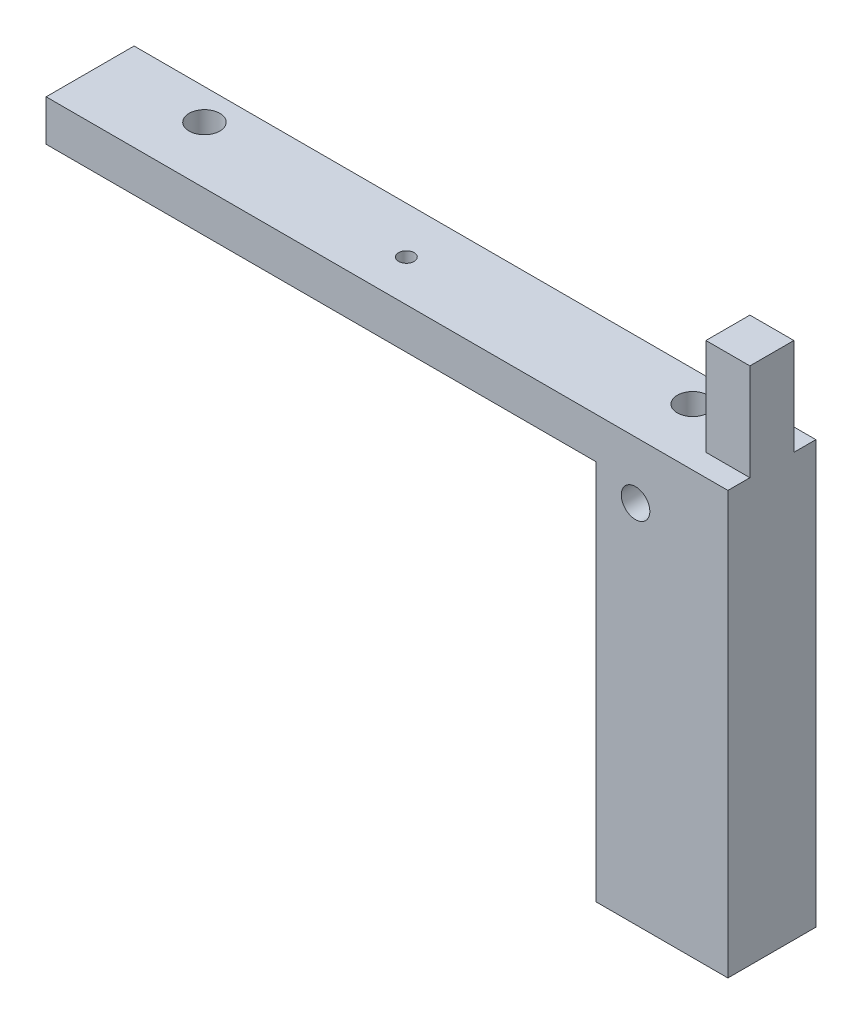
ISO-10303-21;
HEADER;
FILE_DESCRIPTION(('STEP AP214'),'2;1');
FILE_NAME('part.step','',(''),(''),'','','');
FILE_SCHEMA(('AUTOMOTIVE_DESIGN { 1 0 10303 214 1 1 1 1 }'));
ENDSEC;
DATA;
#1=APPLICATION_CONTEXT('core data for automotive mechanical design processes');
#2=APPLICATION_PROTOCOL_DEFINITION('international standard','automotive_design',2000,#1);
#3=PRODUCT_CONTEXT('',#1,'mechanical');
#4=PRODUCT('Part','Part','',(#3));
#5=PRODUCT_RELATED_PRODUCT_CATEGORY('part','',(#4));
#6=PRODUCT_DEFINITION_FORMATION('','',#4);
#7=PRODUCT_DEFINITION_CONTEXT('part definition',#1,'design');
#8=PRODUCT_DEFINITION('design','',#6,#7);
#9=PRODUCT_DEFINITION_SHAPE('','',#8);
#10=(LENGTH_UNIT() NAMED_UNIT(*) SI_UNIT(.MILLI.,.METRE.));
#11=(NAMED_UNIT(*) PLANE_ANGLE_UNIT() SI_UNIT($,.RADIAN.));
#12=(NAMED_UNIT(*) SI_UNIT($,.STERADIAN.) SOLID_ANGLE_UNIT());
#13=UNCERTAINTY_MEASURE_WITH_UNIT(LENGTH_MEASURE(1.E-05),#10,'distance_accuracy_value','');
#14=(GEOMETRIC_REPRESENTATION_CONTEXT(3) GLOBAL_UNCERTAINTY_ASSIGNED_CONTEXT((#13)) GLOBAL_UNIT_ASSIGNED_CONTEXT((#10,
#11,#12)) REPRESENTATION_CONTEXT('',''));
#15=CARTESIAN_POINT('',(0.,0.,0.));
#16=DIRECTION('',(0.,0.,1.));
#17=DIRECTION('',(1.,0.,0.));
#18=AXIS2_PLACEMENT_3D('',#15,#16,#17);
#19=CARTESIAN_POINT('',(0.,0.,0.));
#20=DIRECTION('',(0.,0.,1.));
#21=DIRECTION('',(1.,0.,0.));
#22=AXIS2_PLACEMENT_3D('',#19,#20,#21);
#23=PLANE('',#22);
#24=DIRECTION('',(1.,0.,0.));
#25=VECTOR('',#24,1.);
#26=CARTESIAN_POINT('',(0.,0.,0.));
#27=LINE('',#26,#25);
#28=CARTESIAN_POINT('',(20.,0.,0.));
#29=VERTEX_POINT('',#28);
#30=CARTESIAN_POINT('',(30.,0.,0.));
#31=VERTEX_POINT('',#30);
#32=EDGE_CURVE('E11',#29,#31,#27,.T.);
#33=ORIENTED_EDGE('',*,*,#32,.F.);
#34=DIRECTION('',(0.,-1.,0.));
#35=VECTOR('',#34,1.);
#36=CARTESIAN_POINT('',(20.,0.,0.));
#37=LINE('',#36,#35);
#38=CARTESIAN_POINT('',(20.,22.02,0.));
#39=VERTEX_POINT('',#38);
#40=EDGE_CURVE('E149',#39,#29,#37,.T.);
#41=ORIENTED_EDGE('',*,*,#40,.F.);
#42=DIRECTION('',(-1.,0.,0.));
#43=VECTOR('',#42,1.);
#44=CARTESIAN_POINT('',(20.,22.02,0.));
#45=LINE('',#44,#43);
#46=CARTESIAN_POINT('',(30.,22.02,0.));
#47=VERTEX_POINT('',#46);
#48=EDGE_CURVE('E233',#47,#39,#45,.T.);
#49=ORIENTED_EDGE('',*,*,#48,.F.);
#50=DIRECTION('',(0.,1.,0.));
#51=VECTOR('',#50,1.);
#52=CARTESIAN_POINT('',(30.,22.02,0.));
#53=LINE('',#52,#51);
#54=EDGE_CURVE('E222',#31,#47,#53,.T.);
#55=ORIENTED_EDGE('',*,*,#54,.F.);
#56=EDGE_LOOP('',(#33,#41,#49,#55));
#57=FACE_BOUND('',#56,.T.);
#58=ADVANCED_FACE('F41',(#57),#23,.F.);
#59=CARTESIAN_POINT('',(0.,0.,10.));
#60=DIRECTION('',(0.,-1.,0.));
#61=DIRECTION('',(0.,0.,-1.));
#62=AXIS2_PLACEMENT_3D('',#59,#60,#61);
#63=PLANE('',#62);
#64=CARTESIAN_POINT('',(9.00000000000004,0.,2.00000000000012));
#65=DIRECTION('',(0.,1.,0.));
#66=DIRECTION('',(0.,0.,1.));
#67=AXIS2_PLACEMENT_3D('',#64,#65,#66);
#68=CIRCLE('',#67,3.5);
#69=CARTESIAN_POINT('',(9.00000000000004,0.,5.50000000000012));
#70=VERTEX_POINT('',#69);
#71=EDGE_CURVE('E262',#70,#70,#68,.T.);
#72=ORIENTED_EDGE('',*,*,#71,.F.);
#73=EDGE_LOOP('',(#72));
#74=FACE_BOUND('',#73,.T.);
#75=CARTESIAN_POINT('',(-102.,0.,2.00000000000001));
#76=DIRECTION('',(0.,1.,0.));
#77=DIRECTION('',(0.,0.,1.));
#78=AXIS2_PLACEMENT_3D('',#75,#76,#77);
#79=CIRCLE('',#78,3.50000000000001);
#80=CARTESIAN_POINT('',(-102.,0.,5.50000000000002));
#81=VERTEX_POINT('',#80);
#82=EDGE_CURVE('E254',#81,#81,#79,.T.);
#83=ORIENTED_EDGE('',*,*,#82,.F.);
#84=EDGE_LOOP('',(#83));
#85=FACE_BOUND('',#84,.T.);
#86=CARTESIAN_POINT('',(-52.5,0.,5.59760322214288));
#87=DIRECTION('',(0.,-1.,0.));
#88=DIRECTION('',(0.,0.,-1.));
#89=AXIS2_PLACEMENT_3D('',#86,#87,#88);
#90=CIRCLE('',#89,1.75);
#91=CARTESIAN_POINT('',(-52.5,0.,3.84760322214288));
#92=VERTEX_POINT('',#91);
#93=EDGE_CURVE('E249',#92,#92,#90,.F.);
#94=ORIENTED_EDGE('',*,*,#93,.F.);
#95=EDGE_LOOP('',(#94));
#96=FACE_BOUND('',#95,.T.);
#97=DIRECTION('',(0.,0.,-1.));
#98=VECTOR('',#97,1.);
#99=CARTESIAN_POINT('',(20.,0.,10.));
#100=LINE('',#99,#98);
#101=CARTESIAN_POINT('',(20.,0.,10.));
#102=VERTEX_POINT('',#101);
#103=EDGE_CURVE('E231',#102,#29,#100,.T.);
#104=ORIENTED_EDGE('',*,*,#103,.T.);
#105=ORIENTED_EDGE('',*,*,#32,.T.);
#106=DIRECTION('',(0.,0.,1.));
#107=VECTOR('',#106,1.);
#108=CARTESIAN_POINT('',(30.,0.,-5.));
#109=LINE('',#108,#107);
#110=CARTESIAN_POINT('',(30.,0.,-5.));
#111=VERTEX_POINT('',#110);
#112=EDGE_CURVE('E207',#111,#31,#109,.T.);
#113=ORIENTED_EDGE('',*,*,#112,.F.);
#114=DIRECTION('',(1.,0.,0.));
#115=VECTOR('',#114,1.);
#116=CARTESIAN_POINT('',(0.,0.,-5.));
#117=LINE('',#116,#115);
#118=CARTESIAN_POINT('',(-125.,0.,-5.));
#119=VERTEX_POINT('',#118);
#120=EDGE_CURVE('E184',#119,#111,#117,.T.);
#121=ORIENTED_EDGE('',*,*,#120,.F.);
#122=DIRECTION('',(0.,0.,-1.));
#123=VECTOR('',#122,1.);
#124=CARTESIAN_POINT('',(-125.,0.,0.));
#125=LINE('',#124,#123);
#126=CARTESIAN_POINT('',(-125.,0.,15.));
#127=VERTEX_POINT('',#126);
#128=EDGE_CURVE('E174',#127,#119,#125,.T.);
#129=ORIENTED_EDGE('',*,*,#128,.F.);
#130=DIRECTION('',(-1.,0.,0.));
#131=VECTOR('',#130,1.);
#132=CARTESIAN_POINT('',(0.,0.,15.));
#133=LINE('',#132,#131);
#134=CARTESIAN_POINT('',(30.,0.,15.));
#135=VERTEX_POINT('',#134);
#136=EDGE_CURVE('E216',#135,#127,#133,.T.);
#137=ORIENTED_EDGE('',*,*,#136,.F.);
#138=DIRECTION('',(0.,0.,-1.));
#139=VECTOR('',#138,1.);
#140=CARTESIAN_POINT('',(30.,0.,15.));
#141=LINE('',#140,#139);
#142=CARTESIAN_POINT('',(30.,0.,10.));
#143=VERTEX_POINT('',#142);
#144=EDGE_CURVE('E218',#135,#143,#141,.T.);
#145=ORIENTED_EDGE('',*,*,#144,.T.);
#146=DIRECTION('',(-1.,0.,0.));
#147=VECTOR('',#146,1.);
#148=CARTESIAN_POINT('',(0.,0.,10.));
#149=LINE('',#148,#147);
#150=EDGE_CURVE('E66',#143,#102,#149,.T.);
#151=ORIENTED_EDGE('',*,*,#150,.T.);
#152=EDGE_LOOP('',(#104,#105,#113,#121,#129,#137,#145,#151));
#153=FACE_BOUND('',#152,.T.);
#154=ADVANCED_FACE('F43',(#74,#85,#96,#153),#63,.F.);
#155=CARTESIAN_POINT('',(0.,0.,10.));
#156=DIRECTION('',(1.,0.,0.));
#157=DIRECTION('',(0.,1.,0.));
#158=AXIS2_PLACEMENT_3D('',#155,#156,#157);
#159=PLANE('',#158);
#160=DIRECTION('',(0.,-1.,0.));
#161=VECTOR('',#160,1.);
#162=CARTESIAN_POINT('',(0.,0.,15.));
#163=LINE('',#162,#161);
#164=CARTESIAN_POINT('',(0.,-9.34852743302377,15.));
#165=VERTEX_POINT('',#164);
#166=CARTESIAN_POINT('',(0.,-95.9999999999997,15.));
#167=VERTEX_POINT('',#166);
#168=EDGE_CURVE('E212',#165,#167,#163,.T.);
#169=ORIENTED_EDGE('',*,*,#168,.F.);
#170=DIRECTION('',(0.,0.,-1.));
#171=VECTOR('',#170,1.);
#172=CARTESIAN_POINT('',(0.,-9.34852743302377,0.));
#173=LINE('',#172,#171);
#174=CARTESIAN_POINT('',(0.,-9.34852743302377,10.));
#175=VERTEX_POINT('',#174);
#176=EDGE_CURVE('E163',#165,#175,#173,.T.);
#177=ORIENTED_EDGE('',*,*,#176,.T.);
#178=DIRECTION('',(0.,-1.,0.));
#179=VECTOR('',#178,1.);
#180=CARTESIAN_POINT('',(0.,0.,10.));
#181=LINE('',#180,#179);
#182=CARTESIAN_POINT('',(0.,-95.9999999999997,9.99999999999996));
#183=VERTEX_POINT('',#182);
#184=EDGE_CURVE('E211',#175,#183,#181,.T.);
#185=ORIENTED_EDGE('',*,*,#184,.T.);
#186=DIRECTION('',(0.,0.,-1.));
#187=VECTOR('',#186,1.);
#188=CARTESIAN_POINT('',(0.,-95.9999999999997,15.));
#189=LINE('',#188,#187);
#190=EDGE_CURVE('E185',#167,#183,#189,.T.);
#191=ORIENTED_EDGE('',*,*,#190,.F.);
#192=EDGE_LOOP('',(#169,#177,#185,#191));
#193=FACE_BOUND('',#192,.T.);
#194=ADVANCED_FACE('F271',(#193),#159,.F.);
#195=CARTESIAN_POINT('',(0.,-5.,10.));
#196=DIRECTION('',(0.,1.,0.));
#197=DIRECTION('',(0.,0.,1.));
#198=AXIS2_PLACEMENT_3D('',#195,#196,#197);
#199=PLANE('',#198);
#200=CARTESIAN_POINT('',(9.00000000000004,-5.,2.00000000000012));
#201=DIRECTION('',(0.,1.,0.));
#202=DIRECTION('',(0.,0.,1.));
#203=AXIS2_PLACEMENT_3D('',#200,#201,#202);
#204=CIRCLE('',#203,3.5);
#205=CARTESIAN_POINT('',(9.00000000000004,-5.,5.50000000000012));
#206=VERTEX_POINT('',#205);
#207=EDGE_CURVE('E45',#206,#206,#204,.T.);
#208=ORIENTED_EDGE('',*,*,#207,.T.);
#209=EDGE_LOOP('',(#208));
#210=FACE_BOUND('',#209,.T.);
#211=CARTESIAN_POINT('',(-102.,-5.,2.00000000000001));
#212=DIRECTION('',(0.,1.,0.));
#213=DIRECTION('',(0.,0.,1.));
#214=AXIS2_PLACEMENT_3D('',#211,#212,#213);
#215=CIRCLE('',#214,3.50000000000001);
#216=CARTESIAN_POINT('',(-102.,-5.,5.50000000000002));
#217=VERTEX_POINT('',#216);
#218=EDGE_CURVE('E252',#217,#217,#215,.T.);
#219=ORIENTED_EDGE('',*,*,#218,.T.);
#220=EDGE_LOOP('',(#219));
#221=FACE_BOUND('',#220,.T.);
#222=CARTESIAN_POINT('',(-52.5,-5.,5.59760322214288));
#223=DIRECTION('',(0.,1.,0.));
#224=DIRECTION('',(0.,0.,1.));
#225=AXIS2_PLACEMENT_3D('',#222,#223,#224);
#226=CIRCLE('',#225,1.75);
#227=CARTESIAN_POINT('',(-52.5,-5.,7.34760322214289));
#228=VERTEX_POINT('',#227);
#229=EDGE_CURVE('E250',#228,#228,#226,.F.);
#230=ORIENTED_EDGE('',*,*,#229,.F.);
#231=EDGE_LOOP('',(#230));
#232=FACE_BOUND('',#231,.T.);
#233=DIRECTION('',(1.,0.,0.));
#234=VECTOR('',#233,1.);
#235=CARTESIAN_POINT('',(0.,-5.,10.));
#236=LINE('',#235,#234);
#237=CARTESIAN_POINT('',(-125.,-5.00000000000002,10.));
#238=VERTEX_POINT('',#237);
#239=CARTESIAN_POINT('',(20.,-5.,10.));
#240=VERTEX_POINT('',#239);
#241=EDGE_CURVE('E140',#238,#240,#236,.T.);
#242=ORIENTED_EDGE('',*,*,#241,.F.);
#243=DIRECTION('',(0.,0.,1.));
#244=VECTOR('',#243,1.);
#245=CARTESIAN_POINT('',(-125.,-5.00000000000002,0.));
#246=LINE('',#245,#244);
#247=CARTESIAN_POINT('',(-125.,-5.00000000000002,-5.));
#248=VERTEX_POINT('',#247);
#249=EDGE_CURVE('E145',#248,#238,#246,.T.);
#250=ORIENTED_EDGE('',*,*,#249,.F.);
#251=DIRECTION('',(-1.,0.,0.));
#252=VECTOR('',#251,1.);
#253=CARTESIAN_POINT('',(0.,-5.,-5.));
#254=LINE('',#253,#252);
#255=CARTESIAN_POINT('',(20.,-5.,-5.));
#256=VERTEX_POINT('',#255);
#257=EDGE_CURVE('E206',#256,#248,#254,.T.);
#258=ORIENTED_EDGE('',*,*,#257,.F.);
#259=DIRECTION('',(0.,0.,-1.));
#260=VECTOR('',#259,1.);
#261=CARTESIAN_POINT('',(20.,-5.,10.));
#262=LINE('',#261,#260);
#263=EDGE_CURVE('E50',#240,#256,#262,.T.);
#264=ORIENTED_EDGE('',*,*,#263,.F.);
#265=EDGE_LOOP('',(#242,#250,#258,#264));
#266=FACE_BOUND('',#265,.T.);
#267=ADVANCED_FACE('F142',(#210,#221,#232,#266),#199,.F.);
#268=CARTESIAN_POINT('',(20.,-5.,10.));
#269=DIRECTION('',(1.,0.,0.));
#270=DIRECTION('',(0.,0.,-1.));
#271=AXIS2_PLACEMENT_3D('',#268,#269,#270);
#272=PLANE('',#271);
#273=ORIENTED_EDGE('',*,*,#263,.T.);
#274=DIRECTION('',(0.,1.,0.));
#275=VECTOR('',#274,1.);
#276=CARTESIAN_POINT('',(20.,0.,-5.));
#277=LINE('',#276,#275);
#278=CARTESIAN_POINT('',(20.,-95.9999999999997,-5.00000000000005));
#279=VERTEX_POINT('',#278);
#280=EDGE_CURVE('E203',#279,#256,#277,.T.);
#281=ORIENTED_EDGE('',*,*,#280,.F.);
#282=DIRECTION('',(0.,0.,-1.));
#283=VECTOR('',#282,1.);
#284=CARTESIAN_POINT('',(20.,-95.9999999999997,10.));
#285=LINE('',#284,#283);
#286=CARTESIAN_POINT('',(20.,-95.9999999999997,9.99999999999995));
#287=VERTEX_POINT('',#286);
#288=EDGE_CURVE('E191',#287,#279,#285,.T.);
#289=ORIENTED_EDGE('',*,*,#288,.F.);
#290=DIRECTION('',(0.,-1.,0.));
#291=VECTOR('',#290,1.);
#292=CARTESIAN_POINT('',(20.,-5.,10.));
#293=LINE('',#292,#291);
#294=EDGE_CURVE('E148',#240,#287,#293,.T.);
#295=ORIENTED_EDGE('',*,*,#294,.F.);
#296=EDGE_LOOP('',(#273,#281,#289,#295));
#297=FACE_BOUND('',#296,.T.);
#298=ADVANCED_FACE('F307',(#297),#272,.F.);
#299=CARTESIAN_POINT('',(30.,22.02,10.));
#300=DIRECTION('',(-1.,0.,0.));
#301=DIRECTION('',(0.,0.,1.));
#302=AXIS2_PLACEMENT_3D('',#299,#300,#301);
#303=PLANE('',#302);
#304=DIRECTION('',(0.,1.,0.));
#305=VECTOR('',#304,1.);
#306=CARTESIAN_POINT('',(30.,0.,15.));
#307=LINE('',#306,#305);
#308=CARTESIAN_POINT('',(30.,-95.9999999999997,15.));
#309=VERTEX_POINT('',#308);
#310=EDGE_CURVE('E214',#309,#135,#307,.T.);
#311=ORIENTED_EDGE('',*,*,#310,.F.);
#312=DIRECTION('',(0.,0.,1.));
#313=VECTOR('',#312,1.);
#314=CARTESIAN_POINT('',(30.,-95.9999999999997,-5.));
#315=LINE('',#314,#313);
#316=CARTESIAN_POINT('',(30.,-95.9999999999997,-5.00000000000006));
#317=VERTEX_POINT('',#316);
#318=EDGE_CURVE('E180',#317,#309,#315,.T.);
#319=ORIENTED_EDGE('',*,*,#318,.F.);
#320=DIRECTION('',(0.,-1.,0.));
#321=VECTOR('',#320,1.);
#322=CARTESIAN_POINT('',(30.,0.,-5.));
#323=LINE('',#322,#321);
#324=EDGE_CURVE('E201',#111,#317,#323,.T.);
#325=ORIENTED_EDGE('',*,*,#324,.F.);
#326=ORIENTED_EDGE('',*,*,#112,.T.);
#327=ORIENTED_EDGE('',*,*,#54,.T.);
#328=DIRECTION('',(0.,0.,-1.));
#329=VECTOR('',#328,1.);
#330=CARTESIAN_POINT('',(30.,22.02,10.));
#331=LINE('',#330,#329);
#332=CARTESIAN_POINT('',(30.,22.02,10.));
#333=VERTEX_POINT('',#332);
#334=EDGE_CURVE('E242',#333,#47,#331,.T.);
#335=ORIENTED_EDGE('',*,*,#334,.F.);
#336=DIRECTION('',(0.,1.,0.));
#337=VECTOR('',#336,1.);
#338=CARTESIAN_POINT('',(30.,22.02,10.));
#339=LINE('',#338,#337);
#340=EDGE_CURVE('E225',#143,#333,#339,.T.);
#341=ORIENTED_EDGE('',*,*,#340,.F.);
#342=ORIENTED_EDGE('',*,*,#144,.F.);
#343=EDGE_LOOP('',(#311,#319,#325,#326,#327,#335,#341,#342));
#344=FACE_BOUND('',#343,.T.);
#345=ADVANCED_FACE('F284',(#344),#303,.F.);
#346=CARTESIAN_POINT('',(20.,22.02,10.));
#347=DIRECTION('',(0.,-1.,0.));
#348=DIRECTION('',(0.,0.,-1.));
#349=AXIS2_PLACEMENT_3D('',#346,#347,#348);
#350=PLANE('',#349);
#351=ORIENTED_EDGE('',*,*,#48,.T.);
#352=DIRECTION('',(0.,0.,-1.));
#353=VECTOR('',#352,1.);
#354=CARTESIAN_POINT('',(20.,22.02,10.));
#355=LINE('',#354,#353);
#356=CARTESIAN_POINT('',(20.,22.02,10.));
#357=VERTEX_POINT('',#356);
#358=EDGE_CURVE('E239',#357,#39,#355,.T.);
#359=ORIENTED_EDGE('',*,*,#358,.F.);
#360=DIRECTION('',(-1.,0.,0.));
#361=VECTOR('',#360,1.);
#362=CARTESIAN_POINT('',(20.,22.02,10.));
#363=LINE('',#362,#361);
#364=EDGE_CURVE('E227',#333,#357,#363,.T.);
#365=ORIENTED_EDGE('',*,*,#364,.F.);
#366=ORIENTED_EDGE('',*,*,#334,.T.);
#367=EDGE_LOOP('',(#351,#359,#365,#366));
#368=FACE_BOUND('',#367,.T.);
#369=ADVANCED_FACE('F287',(#368),#350,.F.);
#370=CARTESIAN_POINT('',(20.,0.,10.));
#371=DIRECTION('',(1.,0.,0.));
#372=DIRECTION('',(0.,0.,-1.));
#373=AXIS2_PLACEMENT_3D('',#370,#371,#372);
#374=PLANE('',#373);
#375=ORIENTED_EDGE('',*,*,#40,.T.);
#376=ORIENTED_EDGE('',*,*,#103,.F.);
#377=DIRECTION('',(0.,-1.,0.));
#378=VECTOR('',#377,1.);
#379=CARTESIAN_POINT('',(20.,0.,10.));
#380=LINE('',#379,#378);
#381=EDGE_CURVE('E229',#357,#102,#380,.T.);
#382=ORIENTED_EDGE('',*,*,#381,.F.);
#383=ORIENTED_EDGE('',*,*,#358,.T.);
#384=EDGE_LOOP('',(#375,#376,#382,#383));
#385=FACE_BOUND('',#384,.T.);
#386=ADVANCED_FACE('F277',(#385),#374,.F.);
#387=CARTESIAN_POINT('',(0.,0.,10.));
#388=DIRECTION('',(0.,0.,1.));
#389=DIRECTION('',(1.,0.,0.));
#390=AXIS2_PLACEMENT_3D('',#387,#388,#389);
#391=PLANE('',#390);
#392=ORIENTED_EDGE('',*,*,#150,.F.);
#393=ORIENTED_EDGE('',*,*,#340,.T.);
#394=ORIENTED_EDGE('',*,*,#364,.T.);
#395=ORIENTED_EDGE('',*,*,#381,.T.);
#396=EDGE_LOOP('',(#392,#393,#394,#395));
#397=FACE_BOUND('',#396,.T.);
#398=ADVANCED_FACE('F288',(#397),#391,.T.);
#399=CARTESIAN_POINT('',(0.,0.,10.));
#400=DIRECTION('',(0.,0.,1.));
#401=DIRECTION('',(1.,0.,0.));
#402=AXIS2_PLACEMENT_3D('',#399,#400,#401);
#403=PLANE('',#402);
#404=CARTESIAN_POINT('',(8.99999999999999,-12.9999999999998,10.));
#405=DIRECTION('',(0.,0.,1.));
#406=DIRECTION('',(1.,0.,0.));
#407=AXIS2_PLACEMENT_3D('',#404,#405,#406);
#408=CIRCLE('',#407,3.24999999999995);
#409=CARTESIAN_POINT('',(12.2499999999999,-12.9999999999998,10.));
#410=VERTEX_POINT('',#409);
#411=EDGE_CURVE('E165',#410,#410,#408,.F.);
#412=ORIENTED_EDGE('',*,*,#411,.F.);
#413=EDGE_LOOP('',(#412));
#414=FACE_BOUND('',#413,.T.);
#415=ORIENTED_EDGE('',*,*,#184,.F.);
#416=DIRECTION('',(1.,0.,0.));
#417=VECTOR('',#416,1.);
#418=CARTESIAN_POINT('',(-125.,-9.34852743302379,10.));
#419=LINE('',#418,#417);
#420=CARTESIAN_POINT('',(-125.,-9.34852743302379,10.));
#421=VERTEX_POINT('',#420);
#422=EDGE_CURVE('E58',#421,#175,#419,.T.);
#423=ORIENTED_EDGE('',*,*,#422,.F.);
#424=DIRECTION('',(0.,-1.,0.));
#425=VECTOR('',#424,1.);
#426=CARTESIAN_POINT('',(-125.,0.,10.));
#427=LINE('',#426,#425);
#428=EDGE_CURVE('E151',#238,#421,#427,.T.);
#429=ORIENTED_EDGE('',*,*,#428,.F.);
#430=ORIENTED_EDGE('',*,*,#241,.T.);
#431=ORIENTED_EDGE('',*,*,#294,.T.);
#432=DIRECTION('',(1.,0.,0.));
#433=VECTOR('',#432,1.);
#434=CARTESIAN_POINT('',(0.,-95.9999999999997,10.));
#435=LINE('',#434,#433);
#436=EDGE_CURVE('E194',#183,#287,#435,.T.);
#437=ORIENTED_EDGE('',*,*,#436,.F.);
#438=EDGE_LOOP('',(#415,#423,#429,#430,#431,#437));
#439=FACE_BOUND('',#438,.T.);
#440=ADVANCED_FACE('F153',(#414,#439),#403,.F.);
#441=CARTESIAN_POINT('',(0.,0.,15.));
#442=DIRECTION('',(0.,0.,1.));
#443=DIRECTION('',(1.,0.,0.));
#444=AXIS2_PLACEMENT_3D('',#441,#442,#443);
#445=PLANE('',#444);
#446=CARTESIAN_POINT('',(8.99999999999999,-12.9999999999998,15.));
#447=DIRECTION('',(0.,0.,1.));
#448=DIRECTION('',(1.,0.,0.));
#449=AXIS2_PLACEMENT_3D('',#446,#447,#448);
#450=CIRCLE('',#449,3.24999999999995);
#451=CARTESIAN_POINT('',(12.2499999999999,-12.9999999999998,15.));
#452=VERTEX_POINT('',#451);
#453=EDGE_CURVE('E246',#452,#452,#450,.F.);
#454=ORIENTED_EDGE('',*,*,#453,.T.);
#455=EDGE_LOOP('',(#454));
#456=FACE_BOUND('',#455,.T.);
#457=ORIENTED_EDGE('',*,*,#136,.T.);
#458=DIRECTION('',(0.,1.,0.));
#459=VECTOR('',#458,1.);
#460=CARTESIAN_POINT('',(-125.,0.,15.));
#461=LINE('',#460,#459);
#462=CARTESIAN_POINT('',(-125.,-9.34852743302379,15.));
#463=VERTEX_POINT('',#462);
#464=EDGE_CURVE('E171',#463,#127,#461,.T.);
#465=ORIENTED_EDGE('',*,*,#464,.F.);
#466=DIRECTION('',(1.,0.,0.));
#467=VECTOR('',#466,1.);
#468=CARTESIAN_POINT('',(-125.,-9.34852743302379,15.));
#469=LINE('',#468,#467);
#470=EDGE_CURVE('E176',#463,#165,#469,.T.);
#471=ORIENTED_EDGE('',*,*,#470,.T.);
#472=ORIENTED_EDGE('',*,*,#168,.T.);
#473=DIRECTION('',(-1.,0.,0.));
#474=VECTOR('',#473,1.);
#475=CARTESIAN_POINT('',(30.,-95.9999999999997,15.));
#476=LINE('',#475,#474);
#477=EDGE_CURVE('E181',#309,#167,#476,.T.);
#478=ORIENTED_EDGE('',*,*,#477,.F.);
#479=ORIENTED_EDGE('',*,*,#310,.T.);
#480=EDGE_LOOP('',(#457,#465,#471,#472,#478,#479));
#481=FACE_BOUND('',#480,.T.);
#482=ADVANCED_FACE('F294',(#456,#481),#445,.T.);
#483=CARTESIAN_POINT('',(0.,0.,-5.));
#484=DIRECTION('',(0.,0.,-1.));
#485=DIRECTION('',(-1.,0.,0.));
#486=AXIS2_PLACEMENT_3D('',#483,#484,#485);
#487=PLANE('',#486);
#488=ORIENTED_EDGE('',*,*,#120,.T.);
#489=ORIENTED_EDGE('',*,*,#324,.T.);
#490=DIRECTION('',(1.,0.,0.));
#491=VECTOR('',#490,1.);
#492=CARTESIAN_POINT('',(20.0000000000002,-95.9999999999997,-5.));
#493=LINE('',#492,#491);
#494=EDGE_CURVE('E188',#279,#317,#493,.T.);
#495=ORIENTED_EDGE('',*,*,#494,.F.);
#496=ORIENTED_EDGE('',*,*,#280,.T.);
#497=ORIENTED_EDGE('',*,*,#257,.T.);
#498=DIRECTION('',(0.,-1.,0.));
#499=VECTOR('',#498,1.);
#500=CARTESIAN_POINT('',(-125.,0.,-5.));
#501=LINE('',#500,#499);
#502=EDGE_CURVE('E162',#119,#248,#501,.T.);
#503=ORIENTED_EDGE('',*,*,#502,.F.);
#504=EDGE_LOOP('',(#488,#489,#495,#496,#497,#503));
#505=FACE_BOUND('',#504,.T.);
#506=ADVANCED_FACE('F309',(#505),#487,.T.);
#507=CARTESIAN_POINT('',(30.,-95.9999999999997,9.99999999999994));
#508=DIRECTION('',(0.,-1.,0.));
#509=DIRECTION('',(1.,0.,0.));
#510=AXIS2_PLACEMENT_3D('',#507,#508,#509);
#511=PLANE('',#510);
#512=ORIENTED_EDGE('',*,*,#318,.T.);
#513=ORIENTED_EDGE('',*,*,#477,.T.);
#514=ORIENTED_EDGE('',*,*,#190,.T.);
#515=ORIENTED_EDGE('',*,*,#436,.T.);
#516=ORIENTED_EDGE('',*,*,#288,.T.);
#517=ORIENTED_EDGE('',*,*,#494,.T.);
#518=EDGE_LOOP('',(#512,#513,#514,#515,#516,#517));
#519=FACE_BOUND('',#518,.T.);
#520=ADVANCED_FACE('F301',(#519),#511,.T.);
#521=CARTESIAN_POINT('',(-125.,-9.34852743302379,0.));
#522=DIRECTION('',(0.,-1.,0.));
#523=DIRECTION('',(1.,0.,0.));
#524=AXIS2_PLACEMENT_3D('',#521,#522,#523);
#525=PLANE('',#524);
#526=ORIENTED_EDGE('',*,*,#176,.F.);
#527=ORIENTED_EDGE('',*,*,#470,.F.);
#528=DIRECTION('',(0.,0.,-1.));
#529=VECTOR('',#528,1.);
#530=CARTESIAN_POINT('',(-125.,-9.34852743302379,0.));
#531=LINE('',#530,#529);
#532=EDGE_CURVE('E156',#463,#421,#531,.T.);
#533=ORIENTED_EDGE('',*,*,#532,.T.);
#534=ORIENTED_EDGE('',*,*,#422,.T.);
#535=EDGE_LOOP('',(#526,#527,#533,#534));
#536=FACE_BOUND('',#535,.T.);
#537=ADVANCED_FACE('F296',(#536),#525,.T.);
#538=CARTESIAN_POINT('',(-125.,0.,0.));
#539=DIRECTION('',(-1.,0.,0.));
#540=DIRECTION('',(0.,-1.,0.));
#541=AXIS2_PLACEMENT_3D('',#538,#539,#540);
#542=PLANE('',#541);
#543=ORIENTED_EDGE('',*,*,#249,.T.);
#544=ORIENTED_EDGE('',*,*,#428,.T.);
#545=ORIENTED_EDGE('',*,*,#532,.F.);
#546=ORIENTED_EDGE('',*,*,#464,.T.);
#547=ORIENTED_EDGE('',*,*,#128,.T.);
#548=ORIENTED_EDGE('',*,*,#502,.T.);
#549=EDGE_LOOP('',(#543,#544,#545,#546,#547,#548));
#550=FACE_BOUND('',#549,.T.);
#551=ADVANCED_FACE('F159',(#550),#542,.T.);
#552=CARTESIAN_POINT('',(8.99999999999999,-12.9999999999998,21.));
#553=DIRECTION('',(0.,0.,-1.));
#554=DIRECTION('',(-1.,0.,0.));
#555=AXIS2_PLACEMENT_3D('',#552,#553,#554);
#556=CYLINDRICAL_SURFACE('',#555,3.24999999999995);
#557=ORIENTED_EDGE('',*,*,#453,.F.);
#558=EDGE_LOOP('',(#557));
#559=FACE_BOUND('',#558,.T.);
#560=ORIENTED_EDGE('',*,*,#411,.T.);
#561=EDGE_LOOP('',(#560));
#562=FACE_BOUND('',#561,.T.);
#563=ADVANCED_FACE('F452',(#559,#562),#556,.F.);
#564=CARTESIAN_POINT('',(-52.5,4.99999999999999,5.59760322214288));
#565=DIRECTION('',(0.,-1.,0.));
#566=DIRECTION('',(0.,0.,-1.));
#567=AXIS2_PLACEMENT_3D('',#564,#565,#566);
#568=CYLINDRICAL_SURFACE('',#567,1.75);
#569=ORIENTED_EDGE('',*,*,#229,.T.);
#570=EDGE_LOOP('',(#569));
#571=FACE_BOUND('',#570,.T.);
#572=ORIENTED_EDGE('',*,*,#93,.T.);
#573=EDGE_LOOP('',(#572));
#574=FACE_BOUND('',#573,.T.);
#575=ADVANCED_FACE('F267',(#571,#574),#568,.F.);
#576=CARTESIAN_POINT('',(-102.,-10.,2.00000000000001));
#577=DIRECTION('',(0.,1.,0.));
#578=DIRECTION('',(0.,0.,1.));
#579=AXIS2_PLACEMENT_3D('',#576,#577,#578);
#580=CYLINDRICAL_SURFACE('',#579,3.50000000000001);
#581=ORIENTED_EDGE('',*,*,#82,.T.);
#582=EDGE_LOOP('',(#581));
#583=FACE_BOUND('',#582,.T.);
#584=ORIENTED_EDGE('',*,*,#218,.F.);
#585=EDGE_LOOP('',(#584));
#586=FACE_BOUND('',#585,.T.);
#587=ADVANCED_FACE('F468',(#583,#586),#580,.F.);
#588=CARTESIAN_POINT('',(9.00000000000004,-10.,2.00000000000012));
#589=DIRECTION('',(0.,1.,0.));
#590=DIRECTION('',(0.,0.,1.));
#591=AXIS2_PLACEMENT_3D('',#588,#589,#590);
#592=CYLINDRICAL_SURFACE('',#591,3.5);
#593=ORIENTED_EDGE('',*,*,#71,.T.);
#594=EDGE_LOOP('',(#593));
#595=FACE_BOUND('',#594,.T.);
#596=ORIENTED_EDGE('',*,*,#207,.F.);
#597=EDGE_LOOP('',(#596));
#598=FACE_BOUND('',#597,.T.);
#599=ADVANCED_FACE('F477',(#595,#598),#592,.F.);
#600=CLOSED_SHELL('',(#58,#154,#194,#267,#298,#345,#369,#386,#398,#440,#482,#506,#520,#537,#551,
#563,#575,#587,#599));
#601=MANIFOLD_SOLID_BREP('B2',#600);
#602=ADVANCED_BREP_SHAPE_REPRESENTATION('',(#18,#601),#14);
#603=SHAPE_DEFINITION_REPRESENTATION(#9,#602);
ENDSEC;
END-ISO-10303-21;
